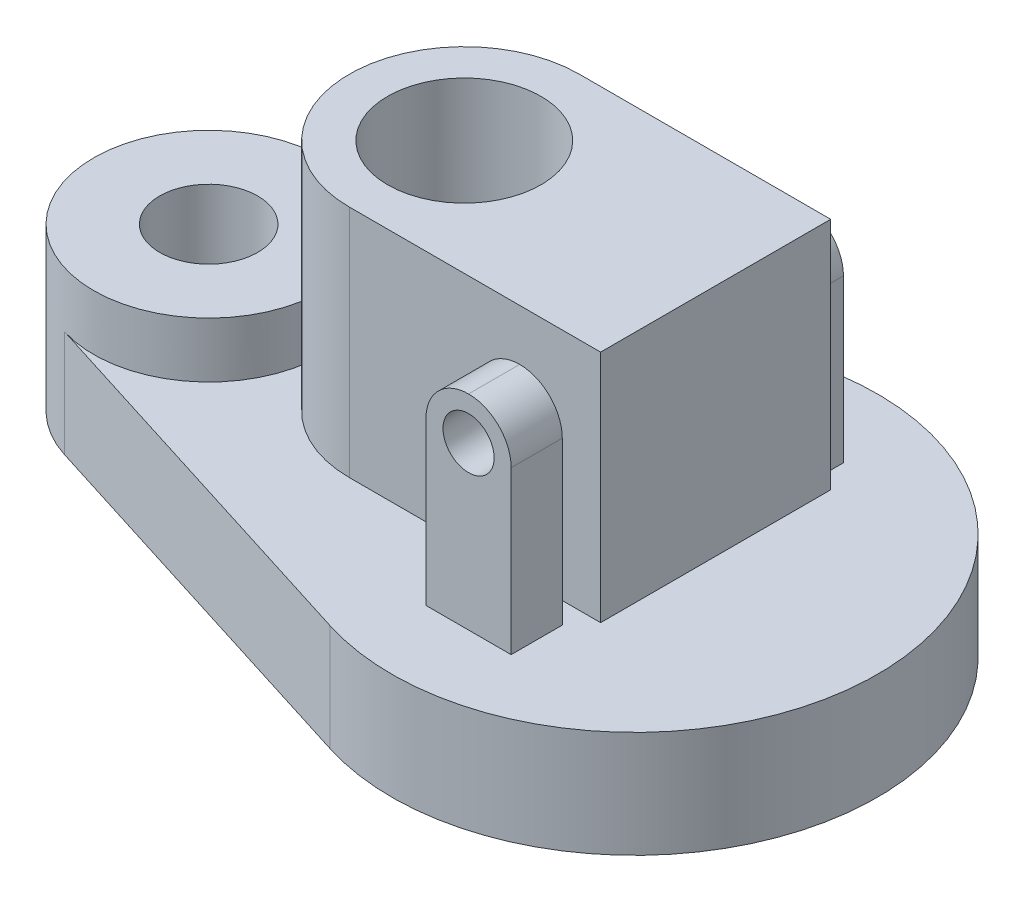
ISO-10303-21;
HEADER;
FILE_DESCRIPTION(('STEP AP214'),'2;1');
FILE_NAME('part.step','',(''),(''),'','','');
FILE_SCHEMA(('AUTOMOTIVE_DESIGN { 1 0 10303 214 1 1 1 1 }'));
ENDSEC;
DATA;
#1=APPLICATION_CONTEXT('core data for automotive mechanical design processes');
#2=APPLICATION_PROTOCOL_DEFINITION('international standard','automotive_design',2000,#1);
#3=PRODUCT_CONTEXT('',#1,'mechanical');
#4=PRODUCT('Part','Part','',(#3));
#5=PRODUCT_RELATED_PRODUCT_CATEGORY('part','',(#4));
#6=PRODUCT_DEFINITION_FORMATION('','',#4);
#7=PRODUCT_DEFINITION_CONTEXT('part definition',#1,'design');
#8=PRODUCT_DEFINITION('design','',#6,#7);
#9=PRODUCT_DEFINITION_SHAPE('','',#8);
#10=(LENGTH_UNIT() NAMED_UNIT(*) SI_UNIT(.MILLI.,.METRE.));
#11=(NAMED_UNIT(*) PLANE_ANGLE_UNIT() SI_UNIT($,.RADIAN.));
#12=(NAMED_UNIT(*) SI_UNIT($,.STERADIAN.) SOLID_ANGLE_UNIT());
#13=UNCERTAINTY_MEASURE_WITH_UNIT(LENGTH_MEASURE(1.E-05),#10,'distance_accuracy_value','');
#14=(GEOMETRIC_REPRESENTATION_CONTEXT(3) GLOBAL_UNCERTAINTY_ASSIGNED_CONTEXT((#13)) GLOBAL_UNIT_ASSIGNED_CONTEXT((#10,
#11,#12)) REPRESENTATION_CONTEXT('',''));
#15=CARTESIAN_POINT('',(0.,0.,0.));
#16=DIRECTION('',(0.,0.,1.));
#17=DIRECTION('',(1.,0.,0.));
#18=AXIS2_PLACEMENT_3D('',#15,#16,#17);
#19=CARTESIAN_POINT('',(0.,25.,0.));
#20=DIRECTION('',(0.,1.,0.));
#21=DIRECTION('',(0.,0.,1.));
#22=AXIS2_PLACEMENT_3D('',#19,#20,#21);
#23=PLANE('',#22);
#24=DIRECTION('',(0.953939201416946,0.,0.3));
#25=VECTOR('',#24,1.);
#26=CARTESIAN_POINT('',(-108.1,25.,25.7563584382575));
#27=LINE('',#26,#25);
#28=CARTESIAN_POINT('',(-108.1,25.,25.7563584382575));
#29=VERTEX_POINT('',#28);
#30=CARTESIAN_POINT('',(-17.1,25.,54.3745344807659));
#31=VERTEX_POINT('',#30);
#32=EDGE_CURVE('E295',#29,#31,#27,.T.);
#33=ORIENTED_EDGE('',*,*,#32,.T.);
#34=CARTESIAN_POINT('',(0.,25.,0.));
#35=DIRECTION('',(0.,1.,0.));
#36=DIRECTION('',(0.,0.,1.));
#37=AXIS2_PLACEMENT_3D('',#34,#35,#36);
#38=CIRCLE('',#37,57.);
#39=CARTESIAN_POINT('',(-17.1,25.,-54.3745344807659));
#40=VERTEX_POINT('',#39);
#41=EDGE_CURVE('E271',#31,#40,#38,.T.);
#42=ORIENTED_EDGE('',*,*,#41,.T.);
#43=DIRECTION('',(-0.953939201416946,0.,0.3));
#44=VECTOR('',#43,1.);
#45=CARTESIAN_POINT('',(-108.1,25.,-25.7563584382575));
#46=LINE('',#45,#44);
#47=CARTESIAN_POINT('',(-108.1,25.,-25.7563584382575));
#48=VERTEX_POINT('',#47);
#49=EDGE_CURVE('E298',#40,#48,#46,.T.);
#50=ORIENTED_EDGE('',*,*,#49,.T.);
#51=CARTESIAN_POINT('',(-100.,25.,0.));
#52=DIRECTION('',(0.,1.,0.));
#53=DIRECTION('',(0.,0.,1.));
#54=AXIS2_PLACEMENT_3D('',#51,#52,#53);
#55=CIRCLE('',#54,27.);
#56=EDGE_CURVE('E281',#29,#48,#55,.T.);
#57=ORIENTED_EDGE('',*,*,#56,.F.);
#58=EDGE_LOOP('',(#33,#42,#50,#57));
#59=FACE_BOUND('',#58,.T.);
#60=DIRECTION('',(1.,0.,0.));
#61=VECTOR('',#60,1.);
#62=CARTESIAN_POINT('',(-10.,25.,39.));
#63=LINE('',#62,#61);
#64=CARTESIAN_POINT('',(-10.,25.,39.));
#65=VERTEX_POINT('',#64);
#66=CARTESIAN_POINT('',(10.,25.,39.));
#67=VERTEX_POINT('',#66);
#68=EDGE_CURVE('E252',#65,#67,#63,.T.);
#69=ORIENTED_EDGE('',*,*,#68,.F.);
#70=DIRECTION('',(0.,0.,1.));
#71=VECTOR('',#70,1.);
#72=CARTESIAN_POINT('',(-10.,25.,27.));
#73=LINE('',#72,#71);
#74=CARTESIAN_POINT('',(-10.,25.,27.));
#75=VERTEX_POINT('',#74);
#76=EDGE_CURVE('E247',#75,#65,#73,.T.);
#77=ORIENTED_EDGE('',*,*,#76,.F.);
#78=DIRECTION('',(-1.,0.,0.));
#79=VECTOR('',#78,1.);
#80=CARTESIAN_POINT('',(-10.,25.,27.));
#81=LINE('',#80,#79);
#82=CARTESIAN_POINT('',(10.,25.,27.));
#83=VERTEX_POINT('',#82);
#84=EDGE_CURVE('E258',#83,#75,#81,.T.);
#85=ORIENTED_EDGE('',*,*,#84,.F.);
#86=DIRECTION('',(0.,0.,-1.));
#87=VECTOR('',#86,1.);
#88=CARTESIAN_POINT('',(10.,25.,27.));
#89=LINE('',#88,#87);
#90=EDGE_CURVE('E255',#67,#83,#89,.T.);
#91=ORIENTED_EDGE('',*,*,#90,.F.);
#92=EDGE_LOOP('',(#69,#77,#85,#91));
#93=FACE_BOUND('',#92,.T.);
#94=DIRECTION('',(1.,0.,0.));
#95=VECTOR('',#94,1.);
#96=CARTESIAN_POINT('',(-10.,25.,-27.));
#97=LINE('',#96,#95);
#98=CARTESIAN_POINT('',(-10.,25.,-27.));
#99=VERTEX_POINT('',#98);
#100=CARTESIAN_POINT('',(10.,25.,-27.));
#101=VERTEX_POINT('',#100);
#102=EDGE_CURVE('E201',#99,#101,#97,.T.);
#103=ORIENTED_EDGE('',*,*,#102,.F.);
#104=DIRECTION('',(0.,0.,1.));
#105=VECTOR('',#104,1.);
#106=CARTESIAN_POINT('',(-10.,25.,-27.));
#107=LINE('',#106,#105);
#108=CARTESIAN_POINT('',(-10.,25.,-39.));
#109=VERTEX_POINT('',#108);
#110=EDGE_CURVE('E183',#109,#99,#107,.T.);
#111=ORIENTED_EDGE('',*,*,#110,.F.);
#112=DIRECTION('',(-1.,0.,0.));
#113=VECTOR('',#112,1.);
#114=CARTESIAN_POINT('',(-10.,25.,-39.));
#115=LINE('',#114,#113);
#116=CARTESIAN_POINT('',(10.,25.,-39.));
#117=VERTEX_POINT('',#116);
#118=EDGE_CURVE('E189',#117,#109,#115,.T.);
#119=ORIENTED_EDGE('',*,*,#118,.F.);
#120=DIRECTION('',(0.,0.,-1.));
#121=VECTOR('',#120,1.);
#122=CARTESIAN_POINT('',(10.,25.,-27.));
#123=LINE('',#122,#121);
#124=EDGE_CURVE('E198',#101,#117,#123,.T.);
#125=ORIENTED_EDGE('',*,*,#124,.F.);
#126=EDGE_LOOP('',(#103,#111,#119,#125));
#127=FACE_BOUND('',#126,.T.);
#128=ADVANCED_FACE('F39',(#59,#93,#127),#23,.T.);
#129=CARTESIAN_POINT('',(0.,85.,-27.));
#130=DIRECTION('',(0.,0.,1.));
#131=DIRECTION('',(1.,0.,0.));
#132=AXIS2_PLACEMENT_3D('',#129,#130,#131);
#133=PLANE('',#132);
#134=CARTESIAN_POINT('',(0.,63.,-27.));
#135=DIRECTION('',(0.,0.,1.));
#136=DIRECTION('',(1.,0.,0.));
#137=AXIS2_PLACEMENT_3D('',#134,#135,#136);
#138=CIRCLE('',#137,10.);
#139=CARTESIAN_POINT('',(10.,63.,-27.));
#140=VERTEX_POINT('',#139);
#141=CARTESIAN_POINT('',(0.,73.,-27.));
#142=VERTEX_POINT('',#141);
#143=EDGE_CURVE('E62',#140,#142,#138,.T.);
#144=ORIENTED_EDGE('',*,*,#143,.T.);
#145=CARTESIAN_POINT('',(0.,63.,-27.));
#146=DIRECTION('',(0.,0.,1.));
#147=DIRECTION('',(1.,0.,0.));
#148=AXIS2_PLACEMENT_3D('',#145,#146,#147);
#149=CIRCLE('',#148,10.);
#150=CARTESIAN_POINT('',(-10.,63.,-27.));
#151=VERTEX_POINT('',#150);
#152=EDGE_CURVE('E329',#142,#151,#149,.T.);
#153=ORIENTED_EDGE('',*,*,#152,.T.);
#154=DIRECTION('',(0.,-1.,0.));
#155=VECTOR('',#154,1.);
#156=CARTESIAN_POINT('',(-10.,73.,-27.));
#157=LINE('',#156,#155);
#158=CARTESIAN_POINT('',(-10.,30.,-27.));
#159=VERTEX_POINT('',#158);
#160=EDGE_CURVE('E348',#151,#159,#157,.T.);
#161=ORIENTED_EDGE('',*,*,#160,.T.);
#162=DIRECTION('',(-1.,0.,0.));
#163=VECTOR('',#162,1.);
#164=CARTESIAN_POINT('',(0.,30.,-27.));
#165=LINE('',#164,#163);
#166=CARTESIAN_POINT('',(-40.,30.,-27.));
#167=VERTEX_POINT('',#166);
#168=EDGE_CURVE('E217',#159,#167,#165,.T.);
#169=ORIENTED_EDGE('',*,*,#168,.T.);
#170=DIRECTION('',(0.,-1.,0.));
#171=VECTOR('',#170,1.);
#172=CARTESIAN_POINT('',(-40.,85.,-27.));
#173=LINE('',#172,#171);
#174=CARTESIAN_POINT('',(-40.,85.,-27.));
#175=VERTEX_POINT('',#174);
#176=EDGE_CURVE('E238',#175,#167,#173,.T.);
#177=ORIENTED_EDGE('',*,*,#176,.F.);
#178=DIRECTION('',(-1.,0.,0.));
#179=VECTOR('',#178,1.);
#180=CARTESIAN_POINT('',(0.,85.,-27.));
#181=LINE('',#180,#179);
#182=CARTESIAN_POINT('',(19.,85.,-27.));
#183=VERTEX_POINT('',#182);
#184=EDGE_CURVE('E230',#183,#175,#181,.T.);
#185=ORIENTED_EDGE('',*,*,#184,.F.);
#186=DIRECTION('',(0.,-1.,0.));
#187=VECTOR('',#186,1.);
#188=CARTESIAN_POINT('',(19.,85.,-27.));
#189=LINE('',#188,#187);
#190=CARTESIAN_POINT('',(19.,30.,-27.));
#191=VERTEX_POINT('',#190);
#192=EDGE_CURVE('E241',#183,#191,#189,.T.);
#193=ORIENTED_EDGE('',*,*,#192,.T.);
#194=CARTESIAN_POINT('',(10.,30.,-27.));
#195=VERTEX_POINT('',#194);
#196=EDGE_CURVE('E218',#191,#195,#165,.T.);
#197=ORIENTED_EDGE('',*,*,#196,.T.);
#198=DIRECTION('',(0.,-1.,0.));
#199=VECTOR('',#198,1.);
#200=CARTESIAN_POINT('',(10.,73.,-27.));
#201=LINE('',#200,#199);
#202=EDGE_CURVE('E351',#140,#195,#201,.T.);
#203=ORIENTED_EDGE('',*,*,#202,.F.);
#204=EDGE_LOOP('',(#144,#153,#161,#169,#177,#185,#193,#197,#203));
#205=FACE_BOUND('',#204,.T.);
#206=ADVANCED_FACE('F368',(#205),#133,.F.);
#207=CARTESIAN_POINT('',(-10.,73.,27.));
#208=DIRECTION('',(0.,0.,1.));
#209=DIRECTION('',(1.,0.,0.));
#210=AXIS2_PLACEMENT_3D('',#207,#208,#209);
#211=PLANE('',#210);
#212=DIRECTION('',(-1.,0.,0.));
#213=VECTOR('',#212,1.);
#214=CARTESIAN_POINT('',(19.,30.,27.));
#215=LINE('',#214,#213);
#216=CARTESIAN_POINT('',(10.,30.,27.));
#217=VERTEX_POINT('',#216);
#218=CARTESIAN_POINT('',(-10.,30.,27.));
#219=VERTEX_POINT('',#218);
#220=EDGE_CURVE('E204',#217,#219,#215,.T.);
#221=ORIENTED_EDGE('',*,*,#220,.F.);
#222=DIRECTION('',(0.,-1.,0.));
#223=VECTOR('',#222,1.);
#224=CARTESIAN_POINT('',(10.,73.,27.));
#225=LINE('',#224,#223);
#226=EDGE_CURVE('E264',#217,#83,#225,.T.);
#227=ORIENTED_EDGE('',*,*,#226,.T.);
#228=ORIENTED_EDGE('',*,*,#84,.T.);
#229=DIRECTION('',(0.,-1.,0.));
#230=VECTOR('',#229,1.);
#231=CARTESIAN_POINT('',(-10.,73.,27.));
#232=LINE('',#231,#230);
#233=EDGE_CURVE('E261',#219,#75,#232,.T.);
#234=ORIENTED_EDGE('',*,*,#233,.F.);
#235=EDGE_LOOP('',(#221,#227,#228,#234));
#236=FACE_BOUND('',#235,.T.);
#237=ADVANCED_FACE('F386',(#236),#211,.F.);
#238=CARTESIAN_POINT('',(0.,25.,0.));
#239=DIRECTION('',(0.,-1.,0.));
#240=DIRECTION('',(0.,0.,-1.));
#241=AXIS2_PLACEMENT_3D('',#238,#239,#240);
#242=CYLINDRICAL_SURFACE('',#241,57.);
#243=CARTESIAN_POINT('',(0.,0.,0.));
#244=DIRECTION('',(0.,1.,0.));
#245=DIRECTION('',(0.,0.,1.));
#246=AXIS2_PLACEMENT_3D('',#243,#244,#245);
#247=CIRCLE('',#246,57.);
#248=CARTESIAN_POINT('',(-17.1,0.,54.3745344807659));
#249=VERTEX_POINT('',#248);
#250=CARTESIAN_POINT('',(-17.1,0.,-54.3745344807659));
#251=VERTEX_POINT('',#250);
#252=EDGE_CURVE('E289',#249,#251,#247,.T.);
#253=ORIENTED_EDGE('',*,*,#252,.T.);
#254=DIRECTION('',(0.,-1.,0.));
#255=VECTOR('',#254,1.);
#256=CARTESIAN_POINT('',(-17.1,25.,-54.3745344807659));
#257=LINE('',#256,#255);
#258=EDGE_CURVE('E272',#40,#251,#257,.T.);
#259=ORIENTED_EDGE('',*,*,#258,.F.);
#260=ORIENTED_EDGE('',*,*,#41,.F.);
#261=DIRECTION('',(0.,-1.,0.));
#262=VECTOR('',#261,1.);
#263=CARTESIAN_POINT('',(-17.1,25.,54.3745344807659));
#264=LINE('',#263,#262);
#265=EDGE_CURVE('E286',#31,#249,#264,.T.);
#266=ORIENTED_EDGE('',*,*,#265,.T.);
#267=EDGE_LOOP('',(#253,#259,#260,#266));
#268=FACE_BOUND('',#267,.T.);
#269=ADVANCED_FACE('F468',(#268),#242,.T.);
#270=CARTESIAN_POINT('',(-108.1,25.,-25.7563584382575));
#271=DIRECTION('',(0.3,0.,0.953939201416946));
#272=DIRECTION('',(0.953939201416946,0.,-0.3));
#273=AXIS2_PLACEMENT_3D('',#270,#271,#272);
#274=PLANE('',#273);
#275=DIRECTION('',(-0.953939201416946,0.,0.3));
#276=VECTOR('',#275,1.);
#277=CARTESIAN_POINT('',(-108.1,0.,-25.7563584382575));
#278=LINE('',#277,#276);
#279=CARTESIAN_POINT('',(-108.1,0.,-25.7563584382575));
#280=VERTEX_POINT('',#279);
#281=EDGE_CURVE('E276',#251,#280,#278,.T.);
#282=ORIENTED_EDGE('',*,*,#281,.T.);
#283=DIRECTION('',(0.,-1.,0.));
#284=VECTOR('',#283,1.);
#285=CARTESIAN_POINT('',(-108.1,25.,-25.7563584382575));
#286=LINE('',#285,#284);
#287=EDGE_CURVE('E277',#48,#280,#286,.T.);
#288=ORIENTED_EDGE('',*,*,#287,.F.);
#289=ORIENTED_EDGE('',*,*,#49,.F.);
#290=ORIENTED_EDGE('',*,*,#258,.T.);
#291=EDGE_LOOP('',(#282,#288,#289,#290));
#292=FACE_BOUND('',#291,.T.);
#293=ADVANCED_FACE('F471',(#292),#274,.F.);
#294=CARTESIAN_POINT('',(-100.,25.,0.));
#295=DIRECTION('',(0.,-1.,0.));
#296=DIRECTION('',(0.,0.,-1.));
#297=AXIS2_PLACEMENT_3D('',#294,#295,#296);
#298=CYLINDRICAL_SURFACE('',#297,27.);
#299=CARTESIAN_POINT('',(-100.,0.,0.));
#300=DIRECTION('',(0.,1.,0.));
#301=DIRECTION('',(0.,0.,1.));
#302=AXIS2_PLACEMENT_3D('',#299,#300,#301);
#303=CIRCLE('',#302,27.);
#304=CARTESIAN_POINT('',(-108.1,0.,25.7563584382575));
#305=VERTEX_POINT('',#304);
#306=EDGE_CURVE('E275',#280,#305,#303,.T.);
#307=ORIENTED_EDGE('',*,*,#306,.T.);
#308=DIRECTION('',(0.,-1.,0.));
#309=VECTOR('',#308,1.);
#310=CARTESIAN_POINT('',(-108.1,25.,25.7563584382575));
#311=LINE('',#310,#309);
#312=EDGE_CURVE('E282',#29,#305,#311,.T.);
#313=ORIENTED_EDGE('',*,*,#312,.F.);
#314=ORIENTED_EDGE('',*,*,#56,.T.);
#315=ORIENTED_EDGE('',*,*,#287,.T.);
#316=EDGE_LOOP('',(#307,#313,#314,#315));
#317=FACE_BOUND('',#316,.T.);
#318=CARTESIAN_POINT('',(-100.,38.,0.));
#319=DIRECTION('',(0.,1.,0.));
#320=DIRECTION('',(0.,0.,1.));
#321=AXIS2_PLACEMENT_3D('',#318,#319,#320);
#322=CIRCLE('',#321,27.);
#323=CARTESIAN_POINT('',(-100.,38.,27.));
#324=VERTEX_POINT('',#323);
#325=EDGE_CURVE('E303',#324,#324,#322,.T.);
#326=ORIENTED_EDGE('',*,*,#325,.F.);
#327=EDGE_LOOP('',(#326));
#328=FACE_BOUND('',#327,.T.);
#329=ADVANCED_FACE('F475',(#317,#328),#298,.T.);
#330=CARTESIAN_POINT('',(-108.1,25.,25.7563584382575));
#331=DIRECTION('',(0.3,0.,-0.953939201416946));
#332=DIRECTION('',(-0.953939201416946,0.,-0.3));
#333=AXIS2_PLACEMENT_3D('',#330,#331,#332);
#334=PLANE('',#333);
#335=DIRECTION('',(0.953939201416946,0.,0.3));
#336=VECTOR('',#335,1.);
#337=CARTESIAN_POINT('',(-108.1,0.,25.7563584382575));
#338=LINE('',#337,#336);
#339=EDGE_CURVE('E280',#305,#249,#338,.T.);
#340=ORIENTED_EDGE('',*,*,#339,.T.);
#341=ORIENTED_EDGE('',*,*,#265,.F.);
#342=ORIENTED_EDGE('',*,*,#32,.F.);
#343=ORIENTED_EDGE('',*,*,#312,.T.);
#344=EDGE_LOOP('',(#340,#341,#342,#343));
#345=FACE_BOUND('',#344,.T.);
#346=ADVANCED_FACE('F478',(#345),#334,.F.);
#347=CARTESIAN_POINT('',(0.,0.,0.));
#348=DIRECTION('',(0.,1.,0.));
#349=DIRECTION('',(0.,0.,1.));
#350=AXIS2_PLACEMENT_3D('',#347,#348,#349);
#351=PLANE('',#350);
#352=CARTESIAN_POINT('',(-100.,0.,0.));
#353=DIRECTION('',(0.,1.,0.));
#354=DIRECTION('',(0.,0.,1.));
#355=AXIS2_PLACEMENT_3D('',#352,#353,#354);
#356=CIRCLE('',#355,11.5);
#357=CARTESIAN_POINT('',(-100.,0.,-11.5));
#358=VERTEX_POINT('',#357);
#359=EDGE_CURVE('E285',#358,#358,#356,.T.);
#360=ORIENTED_EDGE('',*,*,#359,.T.);
#361=EDGE_LOOP('',(#360));
#362=FACE_BOUND('',#361,.T.);
#363=ORIENTED_EDGE('',*,*,#252,.F.);
#364=ORIENTED_EDGE('',*,*,#339,.F.);
#365=ORIENTED_EDGE('',*,*,#306,.F.);
#366=ORIENTED_EDGE('',*,*,#281,.F.);
#367=EDGE_LOOP('',(#363,#364,#365,#366));
#368=FACE_BOUND('',#367,.T.);
#369=ADVANCED_FACE('F432',(#362,#368),#351,.F.);
#370=CARTESIAN_POINT('',(-100.,38.,0.));
#371=DIRECTION('',(0.,1.,0.));
#372=DIRECTION('',(0.,0.,1.));
#373=AXIS2_PLACEMENT_3D('',#370,#371,#372);
#374=PLANE('',#373);
#375=ORIENTED_EDGE('',*,*,#325,.T.);
#376=EDGE_LOOP('',(#375));
#377=FACE_BOUND('',#376,.T.);
#378=CARTESIAN_POINT('',(-100.,38.,0.));
#379=DIRECTION('',(0.,1.,0.));
#380=DIRECTION('',(0.,0.,1.));
#381=AXIS2_PLACEMENT_3D('',#378,#379,#380);
#382=CIRCLE('',#381,11.5);
#383=CARTESIAN_POINT('',(-100.,38.,-11.5));
#384=VERTEX_POINT('',#383);
#385=EDGE_CURVE('E306',#384,#384,#382,.T.);
#386=ORIENTED_EDGE('',*,*,#385,.F.);
#387=EDGE_LOOP('',(#386));
#388=FACE_BOUND('',#387,.T.);
#389=ADVANCED_FACE('F434',(#377,#388),#374,.T.);
#390=CARTESIAN_POINT('',(-100.,38.,0.));
#391=DIRECTION('',(0.,-1.,0.));
#392=DIRECTION('',(0.,0.,-1.));
#393=AXIS2_PLACEMENT_3D('',#390,#391,#392);
#394=CYLINDRICAL_SURFACE('',#393,11.5);
#395=CARTESIAN_POINT('',(-100.,38.,-11.5));
#396=CARTESIAN_POINT('',(-100.,37.6041666666667,-11.5));
#397=CARTESIAN_POINT('',(-100.,37.2083333333333,-11.5));
#398=CARTESIAN_POINT('',(-100.,36.4166666666667,-11.5));
#399=CARTESIAN_POINT('',(-100.,36.0208333333333,-11.5));
#400=CARTESIAN_POINT('',(-100.,35.2291666666667,-11.5));
#401=CARTESIAN_POINT('',(-100.,34.8333333333333,-11.5));
#402=CARTESIAN_POINT('',(-100.,34.0416666666667,-11.5));
#403=CARTESIAN_POINT('',(-100.,33.6458333333333,-11.5));
#404=CARTESIAN_POINT('',(-100.,32.8541666666667,-11.5));
#405=CARTESIAN_POINT('',(-100.,32.4583333333333,-11.5));
#406=CARTESIAN_POINT('',(-100.,31.6666666666667,-11.5));
#407=CARTESIAN_POINT('',(-100.,31.2708333333333,-11.5));
#408=CARTESIAN_POINT('',(-100.,30.4791666666667,-11.5));
#409=CARTESIAN_POINT('',(-100.,30.0833333333333,-11.5));
#410=CARTESIAN_POINT('',(-100.,29.2916666666667,-11.5));
#411=CARTESIAN_POINT('',(-100.,28.8958333333333,-11.5));
#412=CARTESIAN_POINT('',(-100.,28.1041666666667,-11.5));
#413=CARTESIAN_POINT('',(-100.,27.7083333333333,-11.5));
#414=CARTESIAN_POINT('',(-100.,26.9166666666667,-11.5));
#415=CARTESIAN_POINT('',(-100.,26.5208333333333,-11.5));
#416=CARTESIAN_POINT('',(-100.,25.7291666666667,-11.5));
#417=CARTESIAN_POINT('',(-100.,25.3333333333333,-11.5));
#418=CARTESIAN_POINT('',(-100.,24.5416666666667,-11.5));
#419=CARTESIAN_POINT('',(-100.,24.1458333333333,-11.5));
#420=CARTESIAN_POINT('',(-100.,23.3541666666667,-11.5));
#421=CARTESIAN_POINT('',(-100.,22.9583333333333,-11.5));
#422=CARTESIAN_POINT('',(-100.,22.1666666666667,-11.5));
#423=CARTESIAN_POINT('',(-100.,21.7708333333333,-11.5));
#424=CARTESIAN_POINT('',(-100.,20.9791666666667,-11.5));
#425=CARTESIAN_POINT('',(-100.,20.5833333333333,-11.5));
#426=CARTESIAN_POINT('',(-100.,19.7916666666667,-11.5));
#427=CARTESIAN_POINT('',(-100.,19.3958333333333,-11.5));
#428=CARTESIAN_POINT('',(-100.,18.6041666666667,-11.5));
#429=CARTESIAN_POINT('',(-100.,18.2083333333333,-11.5));
#430=CARTESIAN_POINT('',(-100.,17.4166666666667,-11.5));
#431=CARTESIAN_POINT('',(-100.,17.0208333333333,-11.5));
#432=CARTESIAN_POINT('',(-100.,16.2291666666667,-11.5));
#433=CARTESIAN_POINT('',(-100.,15.8333333333333,-11.5));
#434=CARTESIAN_POINT('',(-100.,15.0416666666667,-11.5));
#435=CARTESIAN_POINT('',(-100.,14.6458333333333,-11.5));
#436=CARTESIAN_POINT('',(-100.,13.8541666666667,-11.5));
#437=CARTESIAN_POINT('',(-100.,13.4583333333333,-11.5));
#438=CARTESIAN_POINT('',(-100.,12.6666666666667,-11.5));
#439=CARTESIAN_POINT('',(-100.,12.2708333333333,-11.5));
#440=CARTESIAN_POINT('',(-100.,11.4791666666667,-11.5));
#441=CARTESIAN_POINT('',(-100.,11.0833333333333,-11.5));
#442=CARTESIAN_POINT('',(-100.,10.2916666666667,-11.5));
#443=CARTESIAN_POINT('',(-100.,9.89583333333333,-11.5));
#444=CARTESIAN_POINT('',(-100.,9.10416666666667,-11.5));
#445=CARTESIAN_POINT('',(-100.,8.70833333333333,-11.5));
#446=CARTESIAN_POINT('',(-100.,7.91666666666667,-11.5));
#447=CARTESIAN_POINT('',(-100.,7.52083333333333,-11.5));
#448=CARTESIAN_POINT('',(-100.,6.72916666666667,-11.5));
#449=CARTESIAN_POINT('',(-100.,6.33333333333333,-11.5));
#450=CARTESIAN_POINT('',(-100.,5.54166666666666,-11.5));
#451=CARTESIAN_POINT('',(-100.,5.14583333333333,-11.5));
#452=CARTESIAN_POINT('',(-100.,4.35416666666667,-11.5));
#453=CARTESIAN_POINT('',(-100.,3.95833333333333,-11.5));
#454=CARTESIAN_POINT('',(-100.,3.16666666666667,-11.5));
#455=CARTESIAN_POINT('',(-100.,2.77083333333334,-11.5));
#456=CARTESIAN_POINT('',(-100.,1.97916666666667,-11.5));
#457=CARTESIAN_POINT('',(-100.,1.58333333333333,-11.5));
#458=CARTESIAN_POINT('',(-100.,0.791666666666668,-11.5));
#459=CARTESIAN_POINT('',(-100.,0.395833333333334,-11.5));
#460=CARTESIAN_POINT('',(-100.,0.,-11.5));
#461=B_SPLINE_CURVE_WITH_KNOTS('',3,(#395,#396,#397,#398,#399,#400,#401,#402,#403,#404,#405,
#406,#407,#408,#409,#410,#411,#412,#413,#414,#415,#416,#417,#418,#419,#420,#421,#422,#423,#424,
#425,#426,#427,#428,#429,#430,#431,#432,#433,#434,#435,#436,#437,#438,#439,#440,#441,#442,#443,
#444,#445,#446,#447,#448,#449,#450,#451,#452,#453,#454,#455,#456,#457,#458,#459,#460),
.UNSPECIFIED.,.F.,.F.,(4,2,2,2,2,2,2,2,2,2,2,2,2,2,2,2,2,2,2,2,2,2,2,2,2,2,2,2,2,2,2,2,4),(0.,
1.18749999999999,2.375,3.5625,4.75,5.9375,7.125,8.31249999999999,9.49999999999999,10.6875,
11.875,13.0625,14.25,15.4375,16.625,17.8125,19.,20.1875,21.375,22.5625,23.75,24.9375,26.125,
27.3125,28.5,29.6875,30.875,32.0625,33.25,34.4375,35.625,36.8125,38.),.UNSPECIFIED.);
#462=EDGE_CURVE('BSEAM437',#384,#358,#461,.T.);
#463=ORIENTED_EDGE('',*,*,#385,.T.);
#464=ORIENTED_EDGE('',*,*,#359,.F.);
#465=ORIENTED_EDGE('',*,*,#462,.T.);
#466=ORIENTED_EDGE('',*,*,#462,.F.);
#467=EDGE_LOOP('',(#463,#465,#464,#466));
#468=FACE_BOUND('',#467,.T.);
#469=ADVANCED_FACE('F437',(#468),#394,.F.);
#470=CARTESIAN_POINT('',(-10.,73.,27.));
#471=DIRECTION('',(1.,0.,0.));
#472=DIRECTION('',(0.,0.,-1.));
#473=AXIS2_PLACEMENT_3D('',#470,#471,#472);
#474=PLANE('',#473);
#475=DIRECTION('',(0.,-1.,0.));
#476=VECTOR('',#475,1.);
#477=CARTESIAN_POINT('',(-10.,73.,39.));
#478=LINE('',#477,#476);
#479=CARTESIAN_POINT('',(-10.,63.,39.));
#480=VERTEX_POINT('',#479);
#481=EDGE_CURVE('E269',#480,#65,#478,.T.);
#482=ORIENTED_EDGE('',*,*,#481,.F.);
#483=DIRECTION('',(0.,0.,1.));
#484=VECTOR('',#483,1.);
#485=CARTESIAN_POINT('',(-10.,63.,27.));
#486=LINE('',#485,#484);
#487=CARTESIAN_POINT('',(-10.,63.,27.));
#488=VERTEX_POINT('',#487);
#489=EDGE_CURVE('E326',#480,#488,#486,.F.);
#490=ORIENTED_EDGE('',*,*,#489,.T.);
#491=EDGE_CURVE('E262',#488,#219,#232,.T.);
#492=ORIENTED_EDGE('',*,*,#491,.T.);
#493=ORIENTED_EDGE('',*,*,#233,.T.);
#494=ORIENTED_EDGE('',*,*,#76,.T.);
#495=EDGE_LOOP('',(#482,#490,#492,#493,#494));
#496=FACE_BOUND('',#495,.T.);
#497=ADVANCED_FACE('F398',(#496),#474,.F.);
#498=CARTESIAN_POINT('',(-10.,73.,39.));
#499=DIRECTION('',(0.,0.,-1.));
#500=DIRECTION('',(-1.,0.,0.));
#501=AXIS2_PLACEMENT_3D('',#498,#499,#500);
#502=PLANE('',#501);
#503=CARTESIAN_POINT('',(0.,63.,39.));
#504=DIRECTION('',(0.,0.,1.));
#505=DIRECTION('',(1.,0.,0.));
#506=AXIS2_PLACEMENT_3D('',#503,#504,#505);
#507=CIRCLE('',#506,6.);
#508=CARTESIAN_POINT('',(6.,63.,39.));
#509=VERTEX_POINT('',#508);
#510=EDGE_CURVE('E340',#509,#509,#507,.T.);
#511=ORIENTED_EDGE('',*,*,#510,.F.);
#512=EDGE_LOOP('',(#511));
#513=FACE_BOUND('',#512,.T.);
#514=DIRECTION('',(0.,-1.,0.));
#515=VECTOR('',#514,1.);
#516=CARTESIAN_POINT('',(10.,73.,39.));
#517=LINE('',#516,#515);
#518=CARTESIAN_POINT('',(10.,63.,39.));
#519=VERTEX_POINT('',#518);
#520=EDGE_CURVE('E267',#519,#67,#517,.T.);
#521=ORIENTED_EDGE('',*,*,#520,.F.);
#522=CARTESIAN_POINT('',(0.,63.,39.));
#523=DIRECTION('',(0.,0.,-1.));
#524=DIRECTION('',(-1.,0.,0.));
#525=AXIS2_PLACEMENT_3D('',#522,#523,#524);
#526=CIRCLE('',#525,10.);
#527=CARTESIAN_POINT('',(0.,73.,39.));
#528=VERTEX_POINT('',#527);
#529=EDGE_CURVE('E324',#519,#528,#526,.F.);
#530=ORIENTED_EDGE('',*,*,#529,.T.);
#531=CARTESIAN_POINT('',(0.,63.,39.));
#532=DIRECTION('',(0.,0.,-1.));
#533=DIRECTION('',(-1.,0.,0.));
#534=AXIS2_PLACEMENT_3D('',#531,#532,#533);
#535=CIRCLE('',#534,10.);
#536=EDGE_CURVE('E322',#528,#480,#535,.F.);
#537=ORIENTED_EDGE('',*,*,#536,.T.);
#538=ORIENTED_EDGE('',*,*,#481,.T.);
#539=ORIENTED_EDGE('',*,*,#68,.T.);
#540=EDGE_LOOP('',(#521,#530,#537,#538,#539));
#541=FACE_BOUND('',#540,.T.);
#542=ADVANCED_FACE('F456',(#513,#541),#502,.F.);
#543=CARTESIAN_POINT('',(10.,73.,27.));
#544=DIRECTION('',(-1.,0.,0.));
#545=DIRECTION('',(0.,0.,1.));
#546=AXIS2_PLACEMENT_3D('',#543,#544,#545);
#547=PLANE('',#546);
#548=CARTESIAN_POINT('',(10.,63.,27.));
#549=VERTEX_POINT('',#548);
#550=EDGE_CURVE('E265',#549,#217,#225,.T.);
#551=ORIENTED_EDGE('',*,*,#550,.F.);
#552=DIRECTION('',(0.,0.,-1.));
#553=VECTOR('',#552,1.);
#554=CARTESIAN_POINT('',(10.,63.,39.));
#555=LINE('',#554,#553);
#556=EDGE_CURVE('E319',#549,#519,#555,.F.);
#557=ORIENTED_EDGE('',*,*,#556,.T.);
#558=ORIENTED_EDGE('',*,*,#520,.T.);
#559=ORIENTED_EDGE('',*,*,#90,.T.);
#560=ORIENTED_EDGE('',*,*,#226,.F.);
#561=EDGE_LOOP('',(#551,#557,#558,#559,#560));
#562=FACE_BOUND('',#561,.T.);
#563=ADVANCED_FACE('F388',(#562),#547,.F.);
#564=CARTESIAN_POINT('',(0.,85.,27.));
#565=DIRECTION('',(0.,0.,-1.));
#566=DIRECTION('',(-1.,0.,0.));
#567=AXIS2_PLACEMENT_3D('',#564,#565,#566);
#568=PLANE('',#567);
#569=CARTESIAN_POINT('',(-40.,30.,27.));
#570=VERTEX_POINT('',#569);
#571=EDGE_CURVE('E202',#219,#570,#215,.T.);
#572=ORIENTED_EDGE('',*,*,#571,.F.);
#573=ORIENTED_EDGE('',*,*,#491,.F.);
#574=CARTESIAN_POINT('',(0.,63.,27.));
#575=DIRECTION('',(0.,0.,-1.));
#576=DIRECTION('',(-1.,0.,0.));
#577=AXIS2_PLACEMENT_3D('',#574,#575,#576);
#578=CIRCLE('',#577,10.);
#579=CARTESIAN_POINT('',(0.,73.,27.));
#580=VERTEX_POINT('',#579);
#581=EDGE_CURVE('E11',#488,#580,#578,.T.);
#582=ORIENTED_EDGE('',*,*,#581,.T.);
#583=CARTESIAN_POINT('',(0.,63.,27.));
#584=DIRECTION('',(0.,0.,-1.));
#585=DIRECTION('',(-1.,0.,0.));
#586=AXIS2_PLACEMENT_3D('',#583,#584,#585);
#587=CIRCLE('',#586,10.);
#588=EDGE_CURVE('E48',#580,#549,#587,.T.);
#589=ORIENTED_EDGE('',*,*,#588,.T.);
#590=ORIENTED_EDGE('',*,*,#550,.T.);
#591=CARTESIAN_POINT('',(19.,30.,27.));
#592=VERTEX_POINT('',#591);
#593=EDGE_CURVE('E206',#592,#217,#215,.T.);
#594=ORIENTED_EDGE('',*,*,#593,.F.);
#595=DIRECTION('',(0.,-1.,0.));
#596=VECTOR('',#595,1.);
#597=CARTESIAN_POINT('',(19.,85.,27.));
#598=LINE('',#597,#596);
#599=CARTESIAN_POINT('',(19.,85.,27.));
#600=VERTEX_POINT('',#599);
#601=EDGE_CURVE('E244',#600,#592,#598,.T.);
#602=ORIENTED_EDGE('',*,*,#601,.F.);
#603=DIRECTION('',(1.,0.,0.));
#604=VECTOR('',#603,1.);
#605=CARTESIAN_POINT('',(0.,85.,27.));
#606=LINE('',#605,#604);
#607=CARTESIAN_POINT('',(-40.,85.,27.));
#608=VERTEX_POINT('',#607);
#609=EDGE_CURVE('E225',#608,#600,#606,.T.);
#610=ORIENTED_EDGE('',*,*,#609,.F.);
#611=DIRECTION('',(0.,-1.,0.));
#612=VECTOR('',#611,1.);
#613=CARTESIAN_POINT('',(-40.,85.,27.));
#614=LINE('',#613,#612);
#615=EDGE_CURVE('E235',#608,#570,#614,.T.);
#616=ORIENTED_EDGE('',*,*,#615,.T.);
#617=EDGE_LOOP('',(#572,#573,#582,#589,#590,#594,#602,#610,#616));
#618=FACE_BOUND('',#617,.T.);
#619=ADVANCED_FACE('F379',(#618),#568,.F.);
#620=CARTESIAN_POINT('',(-40.,85.,0.));
#621=DIRECTION('',(0.,-1.,0.));
#622=DIRECTION('',(0.,0.,-1.));
#623=AXIS2_PLACEMENT_3D('',#620,#621,#622);
#624=CYLINDRICAL_SURFACE('',#623,27.);
#625=ORIENTED_EDGE('',*,*,#176,.T.);
#626=CARTESIAN_POINT('',(-40.,30.,0.));
#627=DIRECTION('',(0.,1.,0.));
#628=DIRECTION('',(-1.,0.,0.));
#629=AXIS2_PLACEMENT_3D('',#626,#627,#628);
#630=CIRCLE('',#629,27.);
#631=EDGE_CURVE('E214',#167,#570,#630,.T.);
#632=ORIENTED_EDGE('',*,*,#631,.T.);
#633=ORIENTED_EDGE('',*,*,#615,.F.);
#634=CARTESIAN_POINT('',(-40.,85.,0.));
#635=DIRECTION('',(0.,1.,0.));
#636=DIRECTION('',(0.,0.,1.));
#637=AXIS2_PLACEMENT_3D('',#634,#635,#636);
#638=CIRCLE('',#637,27.);
#639=EDGE_CURVE('E232',#175,#608,#638,.T.);
#640=ORIENTED_EDGE('',*,*,#639,.F.);
#641=EDGE_LOOP('',(#625,#632,#633,#640));
#642=FACE_BOUND('',#641,.T.);
#643=ADVANCED_FACE('F403',(#642),#624,.T.);
#644=CARTESIAN_POINT('',(19.,85.,-27.));
#645=DIRECTION('',(-1.,0.,0.));
#646=DIRECTION('',(0.,0.,1.));
#647=AXIS2_PLACEMENT_3D('',#644,#645,#646);
#648=PLANE('',#647);
#649=ORIENTED_EDGE('',*,*,#601,.T.);
#650=DIRECTION('',(0.,0.,1.));
#651=VECTOR('',#650,1.);
#652=CARTESIAN_POINT('',(19.,30.,-57.));
#653=LINE('',#652,#651);
#654=EDGE_CURVE('E211',#191,#592,#653,.T.);
#655=ORIENTED_EDGE('',*,*,#654,.F.);
#656=ORIENTED_EDGE('',*,*,#192,.F.);
#657=DIRECTION('',(0.,0.,-1.));
#658=VECTOR('',#657,1.);
#659=CARTESIAN_POINT('',(19.,85.,-27.));
#660=LINE('',#659,#658);
#661=EDGE_CURVE('E228',#600,#183,#660,.T.);
#662=ORIENTED_EDGE('',*,*,#661,.F.);
#663=EDGE_LOOP('',(#649,#655,#656,#662));
#664=FACE_BOUND('',#663,.T.);
#665=ADVANCED_FACE('F376',(#664),#648,.F.);
#666=CARTESIAN_POINT('',(-40.,85.,0.));
#667=DIRECTION('',(0.,1.,0.));
#668=DIRECTION('',(0.,0.,1.));
#669=AXIS2_PLACEMENT_3D('',#666,#667,#668);
#670=PLANE('',#669);
#671=CARTESIAN_POINT('',(-40.,85.,0.));
#672=DIRECTION('',(0.,1.,0.));
#673=DIRECTION('',(0.,0.,1.));
#674=AXIS2_PLACEMENT_3D('',#671,#672,#673);
#675=CIRCLE('',#674,18.);
#676=CARTESIAN_POINT('',(-40.,85.,18.));
#677=VERTEX_POINT('',#676);
#678=EDGE_CURVE('E221',#677,#677,#675,.T.);
#679=ORIENTED_EDGE('',*,*,#678,.F.);
#680=EDGE_LOOP('',(#679));
#681=FACE_BOUND('',#680,.T.);
#682=ORIENTED_EDGE('',*,*,#609,.T.);
#683=ORIENTED_EDGE('',*,*,#661,.T.);
#684=ORIENTED_EDGE('',*,*,#184,.T.);
#685=ORIENTED_EDGE('',*,*,#639,.T.);
#686=EDGE_LOOP('',(#682,#683,#684,#685));
#687=FACE_BOUND('',#686,.T.);
#688=ADVANCED_FACE('F407',(#681,#687),#670,.T.);
#689=CARTESIAN_POINT('',(-40.,25.,0.));
#690=DIRECTION('',(0.,1.,0.));
#691=DIRECTION('',(0.,0.,1.));
#692=AXIS2_PLACEMENT_3D('',#689,#690,#691);
#693=CYLINDRICAL_SURFACE('',#692,18.);
#694=CARTESIAN_POINT('',(-40.,30.,0.));
#695=DIRECTION('',(0.,1.,0.));
#696=DIRECTION('',(-1.,0.,0.));
#697=AXIS2_PLACEMENT_3D('',#694,#695,#696);
#698=CIRCLE('',#697,18.);
#699=CARTESIAN_POINT('',(-58.,30.,0.));
#700=VERTEX_POINT('',#699);
#701=EDGE_CURVE('E213',#700,#700,#698,.F.);
#702=ORIENTED_EDGE('',*,*,#701,.T.);
#703=EDGE_LOOP('',(#702));
#704=FACE_BOUND('',#703,.T.);
#705=ORIENTED_EDGE('',*,*,#678,.T.);
#706=EDGE_LOOP('',(#705));
#707=FACE_BOUND('',#706,.T.);
#708=ADVANCED_FACE('F409',(#704,#707),#693,.F.);
#709=CARTESIAN_POINT('',(19.,30.,-57.));
#710=DIRECTION('',(0.,1.,0.));
#711=DIRECTION('',(-1.,0.,0.));
#712=AXIS2_PLACEMENT_3D('',#709,#710,#711);
#713=PLANE('',#712);
#714=ORIENTED_EDGE('',*,*,#701,.F.);
#715=EDGE_LOOP('',(#714));
#716=FACE_BOUND('',#715,.T.);
#717=ORIENTED_EDGE('',*,*,#654,.T.);
#718=ORIENTED_EDGE('',*,*,#593,.T.);
#719=ORIENTED_EDGE('',*,*,#220,.T.);
#720=ORIENTED_EDGE('',*,*,#571,.T.);
#721=ORIENTED_EDGE('',*,*,#631,.F.);
#722=ORIENTED_EDGE('',*,*,#168,.F.);
#723=EDGE_CURVE('E222',#195,#159,#165,.T.);
#724=ORIENTED_EDGE('',*,*,#723,.F.);
#725=ORIENTED_EDGE('',*,*,#196,.F.);
#726=EDGE_LOOP('',(#717,#718,#719,#720,#721,#722,#724,#725));
#727=FACE_BOUND('',#726,.T.);
#728=ADVANCED_FACE('F373',(#716,#727),#713,.F.);
#729=CARTESIAN_POINT('',(-10.,73.,-27.));
#730=DIRECTION('',(0.,0.,-1.));
#731=DIRECTION('',(-1.,0.,0.));
#732=AXIS2_PLACEMENT_3D('',#729,#730,#731);
#733=PLANE('',#732);
#734=EDGE_CURVE('E350',#195,#101,#201,.T.);
#735=ORIENTED_EDGE('',*,*,#734,.F.);
#736=ORIENTED_EDGE('',*,*,#723,.T.);
#737=EDGE_CURVE('E334',#159,#99,#157,.T.);
#738=ORIENTED_EDGE('',*,*,#737,.T.);
#739=ORIENTED_EDGE('',*,*,#102,.T.);
#740=EDGE_LOOP('',(#735,#736,#738,#739));
#741=FACE_BOUND('',#740,.T.);
#742=ADVANCED_FACE('F360',(#741),#733,.F.);
#743=CARTESIAN_POINT('',(-10.,73.,-27.));
#744=DIRECTION('',(1.,0.,0.));
#745=DIRECTION('',(0.,0.,-1.));
#746=AXIS2_PLACEMENT_3D('',#743,#744,#745);
#747=PLANE('',#746);
#748=ORIENTED_EDGE('',*,*,#160,.F.);
#749=DIRECTION('',(0.,0.,1.));
#750=VECTOR('',#749,1.);
#751=CARTESIAN_POINT('',(-10.,63.,-27.));
#752=LINE('',#751,#750);
#753=CARTESIAN_POINT('',(-10.,63.,-39.));
#754=VERTEX_POINT('',#753);
#755=EDGE_CURVE('E186',#151,#754,#752,.F.);
#756=ORIENTED_EDGE('',*,*,#755,.T.);
#757=DIRECTION('',(0.,-1.,0.));
#758=VECTOR('',#757,1.);
#759=CARTESIAN_POINT('',(-10.,73.,-39.));
#760=LINE('',#759,#758);
#761=EDGE_CURVE('E177',#754,#109,#760,.T.);
#762=ORIENTED_EDGE('',*,*,#761,.T.);
#763=ORIENTED_EDGE('',*,*,#110,.T.);
#764=ORIENTED_EDGE('',*,*,#737,.F.);
#765=EDGE_LOOP('',(#748,#756,#762,#763,#764));
#766=FACE_BOUND('',#765,.T.);
#767=ADVANCED_FACE('F180',(#766),#747,.F.);
#768=CARTESIAN_POINT('',(10.,73.,-27.));
#769=DIRECTION('',(-1.,0.,0.));
#770=DIRECTION('',(0.,0.,1.));
#771=AXIS2_PLACEMENT_3D('',#768,#769,#770);
#772=PLANE('',#771);
#773=DIRECTION('',(0.,-1.,0.));
#774=VECTOR('',#773,1.);
#775=CARTESIAN_POINT('',(10.,73.,-39.));
#776=LINE('',#775,#774);
#777=CARTESIAN_POINT('',(10.,63.,-39.));
#778=VERTEX_POINT('',#777);
#779=EDGE_CURVE('E190',#778,#117,#776,.T.);
#780=ORIENTED_EDGE('',*,*,#779,.F.);
#781=DIRECTION('',(0.,0.,-1.));
#782=VECTOR('',#781,1.);
#783=CARTESIAN_POINT('',(10.,63.,-27.));
#784=LINE('',#783,#782);
#785=EDGE_CURVE('E315',#778,#140,#784,.F.);
#786=ORIENTED_EDGE('',*,*,#785,.T.);
#787=ORIENTED_EDGE('',*,*,#202,.T.);
#788=ORIENTED_EDGE('',*,*,#734,.T.);
#789=ORIENTED_EDGE('',*,*,#124,.T.);
#790=EDGE_LOOP('',(#780,#786,#787,#788,#789));
#791=FACE_BOUND('',#790,.T.);
#792=ADVANCED_FACE('F354',(#791),#772,.F.);
#793=CARTESIAN_POINT('',(-10.,73.,-39.));
#794=DIRECTION('',(0.,0.,1.));
#795=DIRECTION('',(1.,0.,0.));
#796=AXIS2_PLACEMENT_3D('',#793,#794,#795);
#797=PLANE('',#796);
#798=CARTESIAN_POINT('',(0.,63.,-39.));
#799=DIRECTION('',(0.,0.,1.));
#800=DIRECTION('',(1.,0.,0.));
#801=AXIS2_PLACEMENT_3D('',#798,#799,#800);
#802=CIRCLE('',#801,6.);
#803=CARTESIAN_POINT('',(6.,63.,-39.));
#804=VERTEX_POINT('',#803);
#805=EDGE_CURVE('E43',#804,#804,#802,.T.);
#806=ORIENTED_EDGE('',*,*,#805,.T.);
#807=EDGE_LOOP('',(#806));
#808=FACE_BOUND('',#807,.T.);
#809=CARTESIAN_POINT('',(0.,63.,-39.));
#810=DIRECTION('',(0.,0.,1.));
#811=DIRECTION('',(1.,0.,0.));
#812=AXIS2_PLACEMENT_3D('',#809,#810,#811);
#813=CIRCLE('',#812,10.);
#814=CARTESIAN_POINT('',(0.,73.,-39.));
#815=VERTEX_POINT('',#814);
#816=EDGE_CURVE('E309',#754,#815,#813,.F.);
#817=ORIENTED_EDGE('',*,*,#816,.T.);
#818=CARTESIAN_POINT('',(0.,63.,-39.));
#819=DIRECTION('',(0.,0.,1.));
#820=DIRECTION('',(1.,0.,0.));
#821=AXIS2_PLACEMENT_3D('',#818,#819,#820);
#822=CIRCLE('',#821,10.);
#823=EDGE_CURVE('E313',#815,#778,#822,.F.);
#824=ORIENTED_EDGE('',*,*,#823,.T.);
#825=ORIENTED_EDGE('',*,*,#779,.T.);
#826=ORIENTED_EDGE('',*,*,#118,.T.);
#827=ORIENTED_EDGE('',*,*,#761,.F.);
#828=EDGE_LOOP('',(#817,#824,#825,#826,#827));
#829=FACE_BOUND('',#828,.T.);
#830=ADVANCED_FACE('F193',(#808,#829),#797,.F.);
#831=CARTESIAN_POINT('',(0.,63.,0.));
#832=DIRECTION('',(0.,0.,1.));
#833=DIRECTION('',(1.,0.,0.));
#834=AXIS2_PLACEMENT_3D('',#831,#832,#833);
#835=CYLINDRICAL_SURFACE('',#834,10.);
#836=ORIENTED_EDGE('',*,*,#755,.F.);
#837=ORIENTED_EDGE('',*,*,#152,.F.);
#838=DIRECTION('',(0.,0.,1.));
#839=VECTOR('',#838,1.);
#840=CARTESIAN_POINT('',(0.,73.,0.));
#841=LINE('',#840,#839);
#842=EDGE_CURVE('E332',#815,#142,#841,.T.);
#843=ORIENTED_EDGE('',*,*,#842,.F.);
#844=ORIENTED_EDGE('',*,*,#816,.F.);
#845=EDGE_LOOP('',(#836,#837,#843,#844));
#846=FACE_BOUND('',#845,.T.);
#847=ADVANCED_FACE('F363',(#846),#835,.T.);
#848=CARTESIAN_POINT('',(0.,63.,0.));
#849=DIRECTION('',(0.,0.,-1.));
#850=DIRECTION('',(-1.,0.,0.));
#851=AXIS2_PLACEMENT_3D('',#848,#849,#850);
#852=CYLINDRICAL_SURFACE('',#851,10.);
#853=ORIENTED_EDGE('',*,*,#143,.F.);
#854=ORIENTED_EDGE('',*,*,#785,.F.);
#855=ORIENTED_EDGE('',*,*,#823,.F.);
#856=ORIENTED_EDGE('',*,*,#842,.T.);
#857=EDGE_LOOP('',(#853,#854,#855,#856));
#858=FACE_BOUND('',#857,.T.);
#859=ADVANCED_FACE('F367',(#858),#852,.T.);
#860=CARTESIAN_POINT('',(0.,63.,0.));
#861=DIRECTION('',(0.,0.,-1.));
#862=DIRECTION('',(-1.,0.,0.));
#863=AXIS2_PLACEMENT_3D('',#860,#861,#862);
#864=CYLINDRICAL_SURFACE('',#863,10.);
#865=ORIENTED_EDGE('',*,*,#489,.F.);
#866=ORIENTED_EDGE('',*,*,#536,.F.);
#867=DIRECTION('',(0.,0.,1.));
#868=VECTOR('',#867,1.);
#869=CARTESIAN_POINT('',(0.,73.,39.));
#870=LINE('',#869,#868);
#871=EDGE_CURVE('E335',#580,#528,#870,.T.);
#872=ORIENTED_EDGE('',*,*,#871,.F.);
#873=ORIENTED_EDGE('',*,*,#581,.F.);
#874=EDGE_LOOP('',(#865,#866,#872,#873));
#875=FACE_BOUND('',#874,.T.);
#876=ADVANCED_FACE('F41',(#875),#864,.T.);
#877=CARTESIAN_POINT('',(0.,63.,0.));
#878=DIRECTION('',(0.,0.,1.));
#879=DIRECTION('',(1.,0.,0.));
#880=AXIS2_PLACEMENT_3D('',#877,#878,#879);
#881=CYLINDRICAL_SURFACE('',#880,10.);
#882=ORIENTED_EDGE('',*,*,#529,.F.);
#883=ORIENTED_EDGE('',*,*,#556,.F.);
#884=ORIENTED_EDGE('',*,*,#588,.F.);
#885=ORIENTED_EDGE('',*,*,#871,.T.);
#886=EDGE_LOOP('',(#882,#883,#884,#885));
#887=FACE_BOUND('',#886,.T.);
#888=ADVANCED_FACE('F444',(#887),#881,.T.);
#889=CARTESIAN_POINT('',(0.,63.,-57.));
#890=DIRECTION('',(0.,0.,1.));
#891=DIRECTION('',(1.,0.,0.));
#892=AXIS2_PLACEMENT_3D('',#889,#890,#891);
#893=CYLINDRICAL_SURFACE('',#892,6.);
#894=ORIENTED_EDGE('',*,*,#510,.T.);
#895=EDGE_LOOP('',(#894));
#896=FACE_BOUND('',#895,.T.);
#897=ORIENTED_EDGE('',*,*,#805,.F.);
#898=EDGE_LOOP('',(#897));
#899=FACE_BOUND('',#898,.T.);
#900=ADVANCED_FACE('F446',(#896,#899),#893,.F.);
#901=CLOSED_SHELL('',(#128,#206,#237,#269,#293,#329,#346,#369,#389,#469,#497,#542,#563,#619,
#643,#665,#688,#708,#728,#742,#767,#792,#830,#847,#859,#876,#888,#900));
#902=MANIFOLD_SOLID_BREP('B2',#901);
#903=ADVANCED_BREP_SHAPE_REPRESENTATION('',(#18,#902),#14);
#904=SHAPE_DEFINITION_REPRESENTATION(#9,#903);
ENDSEC;
END-ISO-10303-21;
